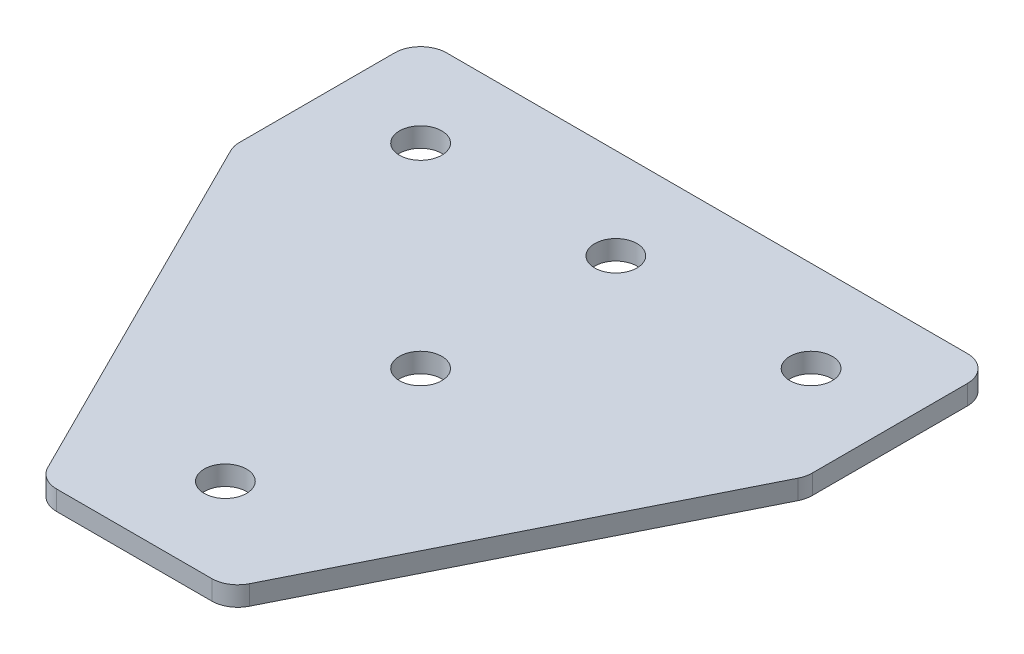
ISO-10303-21;
HEADER;
FILE_DESCRIPTION(('STEP AP214'),'2;1');
FILE_NAME('part.step','',(''),(''),'','','');
FILE_SCHEMA(('AUTOMOTIVE_DESIGN { 1 0 10303 214 1 1 1 1 }'));
ENDSEC;
DATA;
#1=APPLICATION_CONTEXT('core data for automotive mechanical design processes');
#2=APPLICATION_PROTOCOL_DEFINITION('international standard','automotive_design',2000,#1);
#3=PRODUCT_CONTEXT('',#1,'mechanical');
#4=PRODUCT('Part','Part','',(#3));
#5=PRODUCT_RELATED_PRODUCT_CATEGORY('part','',(#4));
#6=PRODUCT_DEFINITION_FORMATION('','',#4);
#7=PRODUCT_DEFINITION_CONTEXT('part definition',#1,'design');
#8=PRODUCT_DEFINITION('design','',#6,#7);
#9=PRODUCT_DEFINITION_SHAPE('','',#8);
#10=(LENGTH_UNIT() NAMED_UNIT(*) SI_UNIT(.MILLI.,.METRE.));
#11=(NAMED_UNIT(*) PLANE_ANGLE_UNIT() SI_UNIT($,.RADIAN.));
#12=(NAMED_UNIT(*) SI_UNIT($,.STERADIAN.) SOLID_ANGLE_UNIT());
#13=UNCERTAINTY_MEASURE_WITH_UNIT(LENGTH_MEASURE(1.E-05),#10,'distance_accuracy_value','');
#14=(GEOMETRIC_REPRESENTATION_CONTEXT(3) GLOBAL_UNCERTAINTY_ASSIGNED_CONTEXT((#13)) GLOBAL_UNIT_ASSIGNED_CONTEXT((#10,
#11,#12)) REPRESENTATION_CONTEXT('',''));
#15=CARTESIAN_POINT('',(0.,0.,0.));
#16=DIRECTION('',(0.,0.,1.));
#17=DIRECTION('',(1.,0.,0.));
#18=AXIS2_PLACEMENT_3D('',#15,#16,#17);
#19=CARTESIAN_POINT('',(-1.37420990733972,2.17462627720624,-16.5499410746997));
#20=DIRECTION('',(0.,-1.,0.));
#21=DIRECTION('',(0.,0.,-1.));
#22=AXIS2_PLACEMENT_3D('',#19,#20,#21);
#23=PLANE('',#22);
#24=CARTESIAN_POINT('',(-1.37420990733972,2.17462627720624,-16.5499410746997));
#25=DIRECTION('',(0.,1.,0.));
#26=DIRECTION('',(0.,0.,1.));
#27=AXIS2_PLACEMENT_3D('',#24,#25,#26);
#28=CIRCLE('',#27,1.625);
#29=CARTESIAN_POINT('',(-1.37420990733972,2.17462627720624,-14.9249410746997));
#30=VERTEX_POINT('',#29);
#31=EDGE_CURVE('E159',#30,#30,#28,.T.);
#32=ORIENTED_EDGE('',*,*,#31,.T.);
#33=EDGE_LOOP('',(#32));
#34=FACE_BOUND('',#33,.T.);
#35=DIRECTION('',(1.,0.,0.));
#36=VECTOR('',#35,1.);
#37=CARTESIAN_POINT('',(-8.37420990733981,2.17462627720624,20.4500589253003));
#38=LINE('',#37,#36);
#39=CARTESIAN_POINT('',(-7.32912493546507,2.17462627720624,20.4500589253003));
#40=VERTEX_POINT('',#39);
#41=CARTESIAN_POINT('',(4.58070512078563,2.17462627720624,20.4500589253003));
#42=VERTEX_POINT('',#41);
#43=EDGE_CURVE('E168',#40,#42,#38,.T.);
#44=ORIENTED_EDGE('',*,*,#43,.F.);
#45=CARTESIAN_POINT('',(-7.32912493546507,2.17462627720624,18.4500589253002));
#46=DIRECTION('',(0.,-1.,0.));
#47=DIRECTION('',(0.,0.,-1.));
#48=AXIS2_PLACEMENT_3D('',#45,#46,#47);
#49=CIRCLE('',#48,2.);
#50=CARTESIAN_POINT('',(-9.1179793174649,2.17462627720624,19.3444861163002));
#51=VERTEX_POINT('',#50);
#52=EDGE_CURVE('E212',#40,#51,#49,.T.);
#53=ORIENTED_EDGE('',*,*,#52,.T.);
#54=DIRECTION('',(-0.447213595499955,0.,-0.894427190999918));
#55=VECTOR('',#54,1.);
#56=CARTESIAN_POINT('',(-8.56519291296486,2.17462627720624,20.4500589253003));
#57=LINE('',#56,#55);
#58=CARTESIAN_POINT('',(-23.1630642893395,2.17462627720624,-8.74568382744922));
#59=VERTEX_POINT('',#58);
#60=EDGE_CURVE('E132',#51,#59,#57,.T.);
#61=ORIENTED_EDGE('',*,*,#60,.T.);
#62=CARTESIAN_POINT('',(-21.3742099073396,2.17462627720624,-9.64011101844913));
#63=DIRECTION('',(0.,-1.,0.));
#64=DIRECTION('',(0.,0.,-1.));
#65=AXIS2_PLACEMENT_3D('',#62,#63,#64);
#66=CIRCLE('',#65,2.);
#67=CARTESIAN_POINT('',(-23.3742099073396,2.17462627720624,-9.64011101844913));
#68=VERTEX_POINT('',#67);
#69=EDGE_CURVE('E186',#59,#68,#66,.T.);
#70=ORIENTED_EDGE('',*,*,#69,.T.);
#71=DIRECTION('',(0.,0.,-1.));
#72=VECTOR('',#71,1.);
#73=CARTESIAN_POINT('',(-23.3742099073396,2.17462627720624,-9.16797506344956));
#74=LINE('',#73,#72);
#75=CARTESIAN_POINT('',(-23.3742099073396,2.17462627720624,-21.5499410746997));
#76=VERTEX_POINT('',#75);
#77=EDGE_CURVE('E125',#68,#76,#74,.T.);
#78=ORIENTED_EDGE('',*,*,#77,.T.);
#79=CARTESIAN_POINT('',(-21.3742099073396,2.17462627720624,-21.5499410746997));
#80=DIRECTION('',(0.,-1.,0.));
#81=DIRECTION('',(0.,0.,-1.));
#82=AXIS2_PLACEMENT_3D('',#79,#80,#81);
#83=CIRCLE('',#82,2.);
#84=CARTESIAN_POINT('',(-21.3742099073396,2.17462627720624,-23.5499410746997));
#85=VERTEX_POINT('',#84);
#86=EDGE_CURVE('E205',#76,#85,#83,.T.);
#87=ORIENTED_EDGE('',*,*,#86,.T.);
#88=DIRECTION('',(-1.,0.,0.));
#89=VECTOR('',#88,1.);
#90=CARTESIAN_POINT('',(20.6257900926602,2.17462627720624,-23.5499410746998));
#91=LINE('',#90,#89);
#92=CARTESIAN_POINT('',(18.6257900926602,2.17462627720624,-23.5499410746998));
#93=VERTEX_POINT('',#92);
#94=EDGE_CURVE('E165',#93,#85,#91,.T.);
#95=ORIENTED_EDGE('',*,*,#94,.F.);
#96=CARTESIAN_POINT('',(18.6257900926602,2.17462627720624,-21.5499410746998));
#97=DIRECTION('',(0.,-1.,0.));
#98=DIRECTION('',(0.,0.,-1.));
#99=AXIS2_PLACEMENT_3D('',#96,#97,#98);
#100=CIRCLE('',#99,2.);
#101=CARTESIAN_POINT('',(20.6257900926602,2.17462627720624,-21.5499410746998));
#102=VERTEX_POINT('',#101);
#103=EDGE_CURVE('E207',#93,#102,#100,.T.);
#104=ORIENTED_EDGE('',*,*,#103,.T.);
#105=DIRECTION('',(0.,0.,-1.));
#106=VECTOR('',#105,1.);
#107=CARTESIAN_POINT('',(20.6257900926602,2.17462627720624,-9.16797506344956));
#108=LINE('',#107,#106);
#109=CARTESIAN_POINT('',(20.6257900926602,2.17462627720624,-9.64011101844913));
#110=VERTEX_POINT('',#109);
#111=EDGE_CURVE('E126',#110,#102,#108,.T.);
#112=ORIENTED_EDGE('',*,*,#111,.F.);
#113=CARTESIAN_POINT('',(18.6257900926602,2.17462627720624,-9.64011101844913));
#114=DIRECTION('',(0.,-1.,0.));
#115=DIRECTION('',(0.,0.,-1.));
#116=AXIS2_PLACEMENT_3D('',#113,#114,#115);
#117=CIRCLE('',#116,2.);
#118=CARTESIAN_POINT('',(20.41464447466,2.17462627720624,-8.74568382744923));
#119=VERTEX_POINT('',#118);
#120=EDGE_CURVE('E31',#110,#119,#117,.T.);
#121=ORIENTED_EDGE('',*,*,#120,.T.);
#122=DIRECTION('',(0.447213595499954,0.,-0.894427190999918));
#123=VECTOR('',#122,1.);
#124=CARTESIAN_POINT('',(5.81677309828543,2.17462627720624,20.4500589253003));
#125=LINE('',#124,#123);
#126=CARTESIAN_POINT('',(6.36955950278547,2.17462627720624,19.3444861163002));
#127=VERTEX_POINT('',#126);
#128=EDGE_CURVE('E172',#127,#119,#125,.T.);
#129=ORIENTED_EDGE('',*,*,#128,.F.);
#130=CARTESIAN_POINT('',(4.58070512078563,2.17462627720624,18.4500589253003));
#131=DIRECTION('',(0.,-1.,0.));
#132=DIRECTION('',(0.,0.,-1.));
#133=AXIS2_PLACEMENT_3D('',#130,#131,#132);
#134=CIRCLE('',#133,2.);
#135=EDGE_CURVE('E210',#127,#42,#134,.T.);
#136=ORIENTED_EDGE('',*,*,#135,.T.);
#137=EDGE_LOOP('',(#44,#53,#61,#70,#78,#87,#95,#104,#112,#121,#129,#136));
#138=FACE_BOUND('',#137,.T.);
#139=CARTESIAN_POINT('',(-1.37420990733973,2.17462627720624,13.4500589253003));
#140=DIRECTION('',(0.,1.,0.));
#141=DIRECTION('',(0.,0.,1.));
#142=AXIS2_PLACEMENT_3D('',#139,#140,#141);
#143=CIRCLE('',#142,1.625);
#144=CARTESIAN_POINT('',(-1.37420990733973,2.17462627720624,15.0750589253003));
#145=VERTEX_POINT('',#144);
#146=EDGE_CURVE('E140',#145,#145,#143,.T.);
#147=ORIENTED_EDGE('',*,*,#146,.T.);
#148=EDGE_LOOP('',(#147));
#149=FACE_BOUND('',#148,.T.);
#150=CARTESIAN_POINT('',(-1.37420990733973,2.17462627720624,-1.54994107469971));
#151=DIRECTION('',(0.,1.,0.));
#152=DIRECTION('',(0.,0.,1.));
#153=AXIS2_PLACEMENT_3D('',#150,#151,#152);
#154=CIRCLE('',#153,1.625);
#155=CARTESIAN_POINT('',(-1.37420990733973,2.17462627720624,0.0750589253002856));
#156=VERTEX_POINT('',#155);
#157=EDGE_CURVE('E147',#156,#156,#154,.T.);
#158=ORIENTED_EDGE('',*,*,#157,.T.);
#159=EDGE_LOOP('',(#158));
#160=FACE_BOUND('',#159,.T.);
#161=CARTESIAN_POINT('',(13.6257900926603,2.17462627720624,-16.5499410746997));
#162=DIRECTION('',(0.,1.,0.));
#163=DIRECTION('',(0.,0.,1.));
#164=AXIS2_PLACEMENT_3D('',#161,#162,#163);
#165=CIRCLE('',#164,1.625);
#166=CARTESIAN_POINT('',(13.6257900926603,2.17462627720624,-14.9249410746997));
#167=VERTEX_POINT('',#166);
#168=EDGE_CURVE('E153',#167,#167,#165,.T.);
#169=ORIENTED_EDGE('',*,*,#168,.T.);
#170=EDGE_LOOP('',(#169));
#171=FACE_BOUND('',#170,.T.);
#172=CARTESIAN_POINT('',(-16.3742099073397,2.17462627720624,-16.5499410746997));
#173=DIRECTION('',(0.,-1.,0.));
#174=DIRECTION('',(0.,0.,1.));
#175=AXIS2_PLACEMENT_3D('',#172,#173,#174);
#176=CIRCLE('',#175,1.625);
#177=CARTESIAN_POINT('',(-16.3742099073397,2.17462627720624,-14.9249410746997));
#178=VERTEX_POINT('',#177);
#179=EDGE_CURVE('E136',#178,#178,#176,.T.);
#180=ORIENTED_EDGE('',*,*,#179,.F.);
#181=EDGE_LOOP('',(#180));
#182=FACE_BOUND('',#181,.T.);
#183=ADVANCED_FACE('F16',(#34,#138,#149,#160,#171,#182),#23,.T.);
#184=CARTESIAN_POINT('',(20.6257900926602,2.17462627720624,-23.5499410746998));
#185=DIRECTION('',(0.,0.,-1.));
#186=DIRECTION('',(-1.,0.,0.));
#187=AXIS2_PLACEMENT_3D('',#184,#185,#186);
#188=PLANE('',#187);
#189=DIRECTION('',(-1.,0.,0.));
#190=VECTOR('',#189,1.);
#191=CARTESIAN_POINT('',(20.6257900926602,3.67462627720624,-23.5499410746998));
#192=LINE('',#191,#190);
#193=CARTESIAN_POINT('',(18.6257900926602,3.67462627720624,-23.5499410746998));
#194=VERTEX_POINT('',#193);
#195=CARTESIAN_POINT('',(-21.3742099073396,3.67462627720624,-23.5499410746997));
#196=VERTEX_POINT('',#195);
#197=EDGE_CURVE('E162',#194,#196,#192,.T.);
#198=ORIENTED_EDGE('',*,*,#197,.F.);
#199=DIRECTION('',(0.,1.,0.));
#200=VECTOR('',#199,1.);
#201=CARTESIAN_POINT('',(18.6257900926602,2.17462627720624,-23.5499410746998));
#202=LINE('',#201,#200);
#203=EDGE_CURVE('E24',#194,#93,#202,.F.);
#204=ORIENTED_EDGE('',*,*,#203,.T.);
#205=ORIENTED_EDGE('',*,*,#94,.T.);
#206=DIRECTION('',(0.,1.,0.));
#207=VECTOR('',#206,1.);
#208=CARTESIAN_POINT('',(-21.3742099073396,2.17462627720624,-23.5499410746997));
#209=LINE('',#208,#207);
#210=EDGE_CURVE('E223',#85,#196,#209,.T.);
#211=ORIENTED_EDGE('',*,*,#210,.T.);
#212=EDGE_LOOP('',(#198,#204,#205,#211));
#213=FACE_BOUND('',#212,.T.);
#214=ADVANCED_FACE('F229',(#213),#188,.T.);
#215=CARTESIAN_POINT('',(20.6257900926602,2.17462627720624,-9.16797506344956));
#216=DIRECTION('',(1.,0.,0.));
#217=DIRECTION('',(0.,0.,-1.));
#218=AXIS2_PLACEMENT_3D('',#215,#216,#217);
#219=PLANE('',#218);
#220=DIRECTION('',(0.,0.,-1.));
#221=VECTOR('',#220,1.);
#222=CARTESIAN_POINT('',(20.6257900926602,3.67462627720624,-9.16797506344956));
#223=LINE('',#222,#221);
#224=CARTESIAN_POINT('',(20.6257900926602,3.67462627720624,-9.64011101844913));
#225=VERTEX_POINT('',#224);
#226=CARTESIAN_POINT('',(20.6257900926602,3.67462627720624,-21.5499410746998));
#227=VERTEX_POINT('',#226);
#228=EDGE_CURVE('E169',#225,#227,#223,.T.);
#229=ORIENTED_EDGE('',*,*,#228,.F.);
#230=DIRECTION('',(0.,1.,0.));
#231=VECTOR('',#230,1.);
#232=CARTESIAN_POINT('',(20.6257900926602,2.17462627720624,-9.64011101844913));
#233=LINE('',#232,#231);
#234=EDGE_CURVE('E221',#225,#110,#233,.F.);
#235=ORIENTED_EDGE('',*,*,#234,.T.);
#236=ORIENTED_EDGE('',*,*,#111,.T.);
#237=DIRECTION('',(0.,1.,0.));
#238=VECTOR('',#237,1.);
#239=CARTESIAN_POINT('',(20.6257900926602,2.17462627720624,-21.5499410746998));
#240=LINE('',#239,#238);
#241=EDGE_CURVE('E218',#102,#227,#240,.T.);
#242=ORIENTED_EDGE('',*,*,#241,.T.);
#243=EDGE_LOOP('',(#229,#235,#236,#242));
#244=FACE_BOUND('',#243,.T.);
#245=ADVANCED_FACE('F240',(#244),#219,.T.);
#246=CARTESIAN_POINT('',(5.81677309828543,2.17462627720624,20.4500589253003));
#247=DIRECTION('',(0.894427190999918,0.,0.447213595499954));
#248=DIRECTION('',(0.447213595499954,0.,-0.894427190999918));
#249=AXIS2_PLACEMENT_3D('',#246,#247,#248);
#250=PLANE('',#249);
#251=DIRECTION('',(0.447213595499954,0.,-0.894427190999918));
#252=VECTOR('',#251,1.);
#253=CARTESIAN_POINT('',(5.81677309828543,3.67462627720624,20.4500589253003));
#254=LINE('',#253,#252);
#255=CARTESIAN_POINT('',(6.36955950278547,3.67462627720624,19.3444861163002));
#256=VERTEX_POINT('',#255);
#257=CARTESIAN_POINT('',(20.41464447466,3.67462627720624,-8.74568382744923));
#258=VERTEX_POINT('',#257);
#259=EDGE_CURVE('E180',#256,#258,#254,.T.);
#260=ORIENTED_EDGE('',*,*,#259,.F.);
#261=DIRECTION('',(0.,1.,0.));
#262=VECTOR('',#261,1.);
#263=CARTESIAN_POINT('',(6.36955950278547,2.17462627720624,19.3444861163002));
#264=LINE('',#263,#262);
#265=EDGE_CURVE('E38',#256,#127,#264,.F.);
#266=ORIENTED_EDGE('',*,*,#265,.T.);
#267=ORIENTED_EDGE('',*,*,#128,.T.);
#268=DIRECTION('',(0.,1.,0.));
#269=VECTOR('',#268,1.);
#270=CARTESIAN_POINT('',(20.41464447466,2.17462627720624,-8.74568382744922));
#271=LINE('',#270,#269);
#272=EDGE_CURVE('E214',#119,#258,#271,.T.);
#273=ORIENTED_EDGE('',*,*,#272,.T.);
#274=EDGE_LOOP('',(#260,#266,#267,#273));
#275=FACE_BOUND('',#274,.T.);
#276=ADVANCED_FACE('F245',(#275),#250,.T.);
#277=CARTESIAN_POINT('',(-8.37420990733981,2.17462627720624,20.4500589253003));
#278=DIRECTION('',(0.,0.,1.));
#279=DIRECTION('',(1.,0.,0.));
#280=AXIS2_PLACEMENT_3D('',#277,#278,#279);
#281=PLANE('',#280);
#282=DIRECTION('',(1.,0.,0.));
#283=VECTOR('',#282,1.);
#284=CARTESIAN_POINT('',(-8.37420990733981,3.67462627720624,20.4500589253003));
#285=LINE('',#284,#283);
#286=CARTESIAN_POINT('',(-7.32912493546507,3.67462627720624,20.4500589253003));
#287=VERTEX_POINT('',#286);
#288=CARTESIAN_POINT('',(4.58070512078563,3.67462627720624,20.4500589253003));
#289=VERTEX_POINT('',#288);
#290=EDGE_CURVE('E177',#287,#289,#285,.T.);
#291=ORIENTED_EDGE('',*,*,#290,.F.);
#292=DIRECTION('',(0.,1.,0.));
#293=VECTOR('',#292,1.);
#294=CARTESIAN_POINT('',(-7.32912493546507,2.17462627720624,20.4500589253003));
#295=LINE('',#294,#293);
#296=EDGE_CURVE('E203',#287,#40,#295,.F.);
#297=ORIENTED_EDGE('',*,*,#296,.T.);
#298=ORIENTED_EDGE('',*,*,#43,.T.);
#299=DIRECTION('',(0.,1.,0.));
#300=VECTOR('',#299,1.);
#301=CARTESIAN_POINT('',(4.58070512078563,2.17462627720624,20.4500589253003));
#302=LINE('',#301,#300);
#303=EDGE_CURVE('E200',#42,#289,#302,.T.);
#304=ORIENTED_EDGE('',*,*,#303,.T.);
#305=EDGE_LOOP('',(#291,#297,#298,#304));
#306=FACE_BOUND('',#305,.T.);
#307=ADVANCED_FACE('F252',(#306),#281,.T.);
#308=CARTESIAN_POINT('',(-1.37420990733972,3.67462627720624,-16.5499410746997));
#309=DIRECTION('',(0.,-1.,0.));
#310=DIRECTION('',(0.,0.,-1.));
#311=AXIS2_PLACEMENT_3D('',#308,#309,#310);
#312=PLANE('',#311);
#313=CARTESIAN_POINT('',(-1.37420990733972,3.67462627720624,-16.5499410746997));
#314=DIRECTION('',(0.,1.,0.));
#315=DIRECTION('',(0.,0.,1.));
#316=AXIS2_PLACEMENT_3D('',#313,#314,#315);
#317=CIRCLE('',#316,1.625);
#318=CARTESIAN_POINT('',(-1.37420990733972,3.67462627720624,-14.9249410746997));
#319=VERTEX_POINT('',#318);
#320=EDGE_CURVE('E156',#319,#319,#317,.T.);
#321=ORIENTED_EDGE('',*,*,#320,.F.);
#322=EDGE_LOOP('',(#321));
#323=FACE_BOUND('',#322,.T.);
#324=DIRECTION('',(-0.447213595499955,0.,-0.894427190999918));
#325=VECTOR('',#324,1.);
#326=CARTESIAN_POINT('',(-8.56519291296486,3.67462627720624,20.4500589253003));
#327=LINE('',#326,#325);
#328=CARTESIAN_POINT('',(-9.1179793174649,3.67462627720624,19.3444861163002));
#329=VERTEX_POINT('',#328);
#330=CARTESIAN_POINT('',(-23.1630642893395,3.67462627720624,-8.74568382744922));
#331=VERTEX_POINT('',#330);
#332=EDGE_CURVE('E133',#329,#331,#327,.T.);
#333=ORIENTED_EDGE('',*,*,#332,.F.);
#334=CARTESIAN_POINT('',(-7.32912493546507,3.67462627720624,18.4500589253002));
#335=DIRECTION('',(0.,-1.,0.));
#336=DIRECTION('',(0.,0.,-1.));
#337=AXIS2_PLACEMENT_3D('',#334,#335,#336);
#338=CIRCLE('',#337,2.);
#339=EDGE_CURVE('E198',#329,#287,#338,.F.);
#340=ORIENTED_EDGE('',*,*,#339,.T.);
#341=ORIENTED_EDGE('',*,*,#290,.T.);
#342=CARTESIAN_POINT('',(4.58070512078563,3.67462627720624,18.4500589253003));
#343=DIRECTION('',(0.,-1.,0.));
#344=DIRECTION('',(0.,0.,-1.));
#345=AXIS2_PLACEMENT_3D('',#342,#343,#344);
#346=CIRCLE('',#345,2.);
#347=EDGE_CURVE('E196',#289,#256,#346,.F.);
#348=ORIENTED_EDGE('',*,*,#347,.T.);
#349=ORIENTED_EDGE('',*,*,#259,.T.);
#350=CARTESIAN_POINT('',(18.6257900926602,3.67462627720624,-9.64011101844913));
#351=DIRECTION('',(0.,-1.,0.));
#352=DIRECTION('',(0.,0.,-1.));
#353=AXIS2_PLACEMENT_3D('',#350,#351,#352);
#354=CIRCLE('',#353,2.);
#355=EDGE_CURVE('E194',#258,#225,#354,.F.);
#356=ORIENTED_EDGE('',*,*,#355,.T.);
#357=ORIENTED_EDGE('',*,*,#228,.T.);
#358=CARTESIAN_POINT('',(18.6257900926602,3.67462627720624,-21.5499410746998));
#359=DIRECTION('',(0.,-1.,0.));
#360=DIRECTION('',(0.,0.,-1.));
#361=AXIS2_PLACEMENT_3D('',#358,#359,#360);
#362=CIRCLE('',#361,2.);
#363=EDGE_CURVE('E192',#227,#194,#362,.F.);
#364=ORIENTED_EDGE('',*,*,#363,.T.);
#365=ORIENTED_EDGE('',*,*,#197,.T.);
#366=CARTESIAN_POINT('',(-21.3742099073396,3.67462627720624,-21.5499410746997));
#367=DIRECTION('',(0.,-1.,0.));
#368=DIRECTION('',(0.,0.,-1.));
#369=AXIS2_PLACEMENT_3D('',#366,#367,#368);
#370=CIRCLE('',#369,2.);
#371=CARTESIAN_POINT('',(-23.3742099073396,3.67462627720624,-21.5499410746997));
#372=VERTEX_POINT('',#371);
#373=EDGE_CURVE('E131',#196,#372,#370,.F.);
#374=ORIENTED_EDGE('',*,*,#373,.T.);
#375=DIRECTION('',(0.,0.,-1.));
#376=VECTOR('',#375,1.);
#377=CARTESIAN_POINT('',(-23.3742099073396,3.67462627720624,-9.16797506344956));
#378=LINE('',#377,#376);
#379=CARTESIAN_POINT('',(-23.3742099073396,3.67462627720624,-9.64011101844913));
#380=VERTEX_POINT('',#379);
#381=EDGE_CURVE('E122',#380,#372,#378,.T.);
#382=ORIENTED_EDGE('',*,*,#381,.F.);
#383=CARTESIAN_POINT('',(-21.3742099073396,3.67462627720624,-9.64011101844913));
#384=DIRECTION('',(0.,-1.,0.));
#385=DIRECTION('',(0.,0.,-1.));
#386=AXIS2_PLACEMENT_3D('',#383,#384,#385);
#387=CIRCLE('',#386,2.);
#388=EDGE_CURVE('E107',#380,#331,#387,.F.);
#389=ORIENTED_EDGE('',*,*,#388,.T.);
#390=EDGE_LOOP('',(#333,#340,#341,#348,#349,#356,#357,#364,#365,#374,#382,#389));
#391=FACE_BOUND('',#390,.T.);
#392=CARTESIAN_POINT('',(-1.37420990733973,3.67462627720624,13.4500589253003));
#393=DIRECTION('',(0.,1.,0.));
#394=DIRECTION('',(0.,0.,1.));
#395=AXIS2_PLACEMENT_3D('',#392,#393,#394);
#396=CIRCLE('',#395,1.625);
#397=CARTESIAN_POINT('',(-1.37420990733973,3.67462627720624,15.0750589253003));
#398=VERTEX_POINT('',#397);
#399=EDGE_CURVE('E144',#398,#398,#396,.T.);
#400=ORIENTED_EDGE('',*,*,#399,.F.);
#401=EDGE_LOOP('',(#400));
#402=FACE_BOUND('',#401,.T.);
#403=CARTESIAN_POINT('',(13.6257900926603,3.67462627720624,-16.5499410746997));
#404=DIRECTION('',(0.,1.,0.));
#405=DIRECTION('',(0.,0.,1.));
#406=AXIS2_PLACEMENT_3D('',#403,#404,#405);
#407=CIRCLE('',#406,1.625);
#408=CARTESIAN_POINT('',(13.6257900926603,3.67462627720624,-14.9249410746997));
#409=VERTEX_POINT('',#408);
#410=EDGE_CURVE('E150',#409,#409,#407,.T.);
#411=ORIENTED_EDGE('',*,*,#410,.F.);
#412=EDGE_LOOP('',(#411));
#413=FACE_BOUND('',#412,.T.);
#414=CARTESIAN_POINT('',(-1.37420990733973,3.67462627720624,-1.54994107469971));
#415=DIRECTION('',(0.,1.,0.));
#416=DIRECTION('',(0.,0.,1.));
#417=AXIS2_PLACEMENT_3D('',#414,#415,#416);
#418=CIRCLE('',#417,1.625);
#419=CARTESIAN_POINT('',(-1.37420990733973,3.67462627720624,0.0750589253002856));
#420=VERTEX_POINT('',#419);
#421=EDGE_CURVE('E143',#420,#420,#418,.T.);
#422=ORIENTED_EDGE('',*,*,#421,.F.);
#423=EDGE_LOOP('',(#422));
#424=FACE_BOUND('',#423,.T.);
#425=CARTESIAN_POINT('',(-16.3742099073397,3.67462627720624,-16.5499410746997));
#426=DIRECTION('',(0.,-1.,0.));
#427=DIRECTION('',(0.,0.,1.));
#428=AXIS2_PLACEMENT_3D('',#425,#426,#427);
#429=CIRCLE('',#428,1.625);
#430=CARTESIAN_POINT('',(-16.3742099073397,3.67462627720624,-14.9249410746997));
#431=VERTEX_POINT('',#430);
#432=EDGE_CURVE('E444',#431,#431,#429,.T.);
#433=ORIENTED_EDGE('',*,*,#432,.T.);
#434=EDGE_LOOP('',(#433));
#435=FACE_BOUND('',#434,.T.);
#436=ADVANCED_FACE('F128',(#323,#391,#402,#413,#424,#435),#312,.F.);
#437=CARTESIAN_POINT('',(-1.37420990733972,2.17462627720624,-16.5499410746997));
#438=DIRECTION('',(0.,1.,0.));
#439=DIRECTION('',(0.,0.,1.));
#440=AXIS2_PLACEMENT_3D('',#437,#438,#439);
#441=CYLINDRICAL_SURFACE('',#440,1.625);
#442=ORIENTED_EDGE('',*,*,#31,.F.);
#443=EDGE_LOOP('',(#442));
#444=FACE_BOUND('',#443,.T.);
#445=ORIENTED_EDGE('',*,*,#320,.T.);
#446=EDGE_LOOP('',(#445));
#447=FACE_BOUND('',#446,.T.);
#448=ADVANCED_FACE('F370',(#444,#447),#441,.F.);
#449=CARTESIAN_POINT('',(13.6257900926603,2.17462627720624,-16.5499410746997));
#450=DIRECTION('',(0.,1.,0.));
#451=DIRECTION('',(0.,0.,1.));
#452=AXIS2_PLACEMENT_3D('',#449,#450,#451);
#453=CYLINDRICAL_SURFACE('',#452,1.625);
#454=ORIENTED_EDGE('',*,*,#168,.F.);
#455=EDGE_LOOP('',(#454));
#456=FACE_BOUND('',#455,.T.);
#457=ORIENTED_EDGE('',*,*,#410,.T.);
#458=EDGE_LOOP('',(#457));
#459=FACE_BOUND('',#458,.T.);
#460=ADVANCED_FACE('F361',(#456,#459),#453,.F.);
#461=CARTESIAN_POINT('',(-1.37420990733973,2.17462627720624,-1.54994107469971));
#462=DIRECTION('',(0.,1.,0.));
#463=DIRECTION('',(0.,0.,1.));
#464=AXIS2_PLACEMENT_3D('',#461,#462,#463);
#465=CYLINDRICAL_SURFACE('',#464,1.625);
#466=ORIENTED_EDGE('',*,*,#421,.T.);
#467=EDGE_LOOP('',(#466));
#468=FACE_BOUND('',#467,.T.);
#469=ORIENTED_EDGE('',*,*,#157,.F.);
#470=EDGE_LOOP('',(#469));
#471=FACE_BOUND('',#470,.T.);
#472=ADVANCED_FACE('F352',(#468,#471),#465,.F.);
#473=CARTESIAN_POINT('',(-1.37420990733973,2.17462627720624,13.4500589253003));
#474=DIRECTION('',(0.,1.,0.));
#475=DIRECTION('',(0.,0.,1.));
#476=AXIS2_PLACEMENT_3D('',#473,#474,#475);
#477=CYLINDRICAL_SURFACE('',#476,1.625);
#478=ORIENTED_EDGE('',*,*,#399,.T.);
#479=EDGE_LOOP('',(#478));
#480=FACE_BOUND('',#479,.T.);
#481=ORIENTED_EDGE('',*,*,#146,.F.);
#482=EDGE_LOOP('',(#481));
#483=FACE_BOUND('',#482,.T.);
#484=ADVANCED_FACE('F344',(#480,#483),#477,.F.);
#485=CARTESIAN_POINT('',(-23.3742099073396,2.17462627720624,-9.16797506344956));
#486=DIRECTION('',(-1.,0.,0.));
#487=DIRECTION('',(0.,0.,-1.));
#488=AXIS2_PLACEMENT_3D('',#485,#486,#487);
#489=PLANE('',#488);
#490=ORIENTED_EDGE('',*,*,#381,.T.);
#491=DIRECTION('',(0.,1.,0.));
#492=VECTOR('',#491,1.);
#493=CARTESIAN_POINT('',(-23.3742099073396,2.17462627720624,-21.5499410746997));
#494=LINE('',#493,#492);
#495=EDGE_CURVE('E10',#372,#76,#494,.F.);
#496=ORIENTED_EDGE('',*,*,#495,.T.);
#497=ORIENTED_EDGE('',*,*,#77,.F.);
#498=DIRECTION('',(0.,1.,0.));
#499=VECTOR('',#498,1.);
#500=CARTESIAN_POINT('',(-23.3742099073396,2.17462627720624,-9.64011101844913));
#501=LINE('',#500,#499);
#502=EDGE_CURVE('E111',#68,#380,#501,.T.);
#503=ORIENTED_EDGE('',*,*,#502,.T.);
#504=EDGE_LOOP('',(#490,#496,#497,#503));
#505=FACE_BOUND('',#504,.T.);
#506=ADVANCED_FACE('F121',(#505),#489,.T.);
#507=CARTESIAN_POINT('',(-8.56519291296486,2.17462627720624,20.4500589253003));
#508=DIRECTION('',(-0.894427190999918,0.,0.447213595499954));
#509=DIRECTION('',(-0.447213595499955,0.,-0.894427190999918));
#510=AXIS2_PLACEMENT_3D('',#507,#508,#509);
#511=PLANE('',#510);
#512=ORIENTED_EDGE('',*,*,#60,.F.);
#513=DIRECTION('',(0.,1.,0.));
#514=VECTOR('',#513,1.);
#515=CARTESIAN_POINT('',(-9.1179793174649,2.17462627720624,19.3444861163002));
#516=LINE('',#515,#514);
#517=EDGE_CURVE('E188',#51,#329,#516,.T.);
#518=ORIENTED_EDGE('',*,*,#517,.T.);
#519=ORIENTED_EDGE('',*,*,#332,.T.);
#520=DIRECTION('',(0.,1.,0.));
#521=VECTOR('',#520,1.);
#522=CARTESIAN_POINT('',(-23.1630642893395,2.17462627720624,-8.74568382744922));
#523=LINE('',#522,#521);
#524=EDGE_CURVE('E113',#331,#59,#523,.F.);
#525=ORIENTED_EDGE('',*,*,#524,.T.);
#526=EDGE_LOOP('',(#512,#518,#519,#525));
#527=FACE_BOUND('',#526,.T.);
#528=ADVANCED_FACE('F260',(#527),#511,.T.);
#529=CARTESIAN_POINT('',(-16.3742099073397,2.17462627720624,-16.5499410746997));
#530=DIRECTION('',(0.,1.,0.));
#531=DIRECTION('',(0.,0.,1.));
#532=AXIS2_PLACEMENT_3D('',#529,#530,#531);
#533=CYLINDRICAL_SURFACE('',#532,1.625);
#534=ORIENTED_EDGE('',*,*,#179,.T.);
#535=EDGE_LOOP('',(#534));
#536=FACE_BOUND('',#535,.T.);
#537=ORIENTED_EDGE('',*,*,#432,.F.);
#538=EDGE_LOOP('',(#537));
#539=FACE_BOUND('',#538,.T.);
#540=ADVANCED_FACE('F278',(#536,#539),#533,.F.);
#541=CARTESIAN_POINT('',(-21.3742099073396,2.17462627720624,-9.64011101844913));
#542=DIRECTION('',(0.,1.,0.));
#543=DIRECTION('',(0.,0.,1.));
#544=AXIS2_PLACEMENT_3D('',#541,#542,#543);
#545=CYLINDRICAL_SURFACE('',#544,2.);
#546=ORIENTED_EDGE('',*,*,#69,.F.);
#547=ORIENTED_EDGE('',*,*,#524,.F.);
#548=ORIENTED_EDGE('',*,*,#388,.F.);
#549=ORIENTED_EDGE('',*,*,#502,.F.);
#550=EDGE_LOOP('',(#546,#547,#548,#549));
#551=FACE_BOUND('',#550,.T.);
#552=ADVANCED_FACE('F110',(#551),#545,.T.);
#553=CARTESIAN_POINT('',(-7.32912493546507,2.17462627720624,18.4500589253002));
#554=DIRECTION('',(0.,1.,0.));
#555=DIRECTION('',(0.,0.,1.));
#556=AXIS2_PLACEMENT_3D('',#553,#554,#555);
#557=CYLINDRICAL_SURFACE('',#556,2.);
#558=ORIENTED_EDGE('',*,*,#52,.F.);
#559=ORIENTED_EDGE('',*,*,#296,.F.);
#560=ORIENTED_EDGE('',*,*,#339,.F.);
#561=ORIENTED_EDGE('',*,*,#517,.F.);
#562=EDGE_LOOP('',(#558,#559,#560,#561));
#563=FACE_BOUND('',#562,.T.);
#564=ADVANCED_FACE('F257',(#563),#557,.T.);
#565=CARTESIAN_POINT('',(4.58070512078563,2.17462627720624,18.4500589253003));
#566=DIRECTION('',(0.,1.,0.));
#567=DIRECTION('',(0.,0.,1.));
#568=AXIS2_PLACEMENT_3D('',#565,#566,#567);
#569=CYLINDRICAL_SURFACE('',#568,2.);
#570=ORIENTED_EDGE('',*,*,#135,.F.);
#571=ORIENTED_EDGE('',*,*,#265,.F.);
#572=ORIENTED_EDGE('',*,*,#347,.F.);
#573=ORIENTED_EDGE('',*,*,#303,.F.);
#574=EDGE_LOOP('',(#570,#571,#572,#573));
#575=FACE_BOUND('',#574,.T.);
#576=ADVANCED_FACE('F249',(#575),#569,.T.);
#577=CARTESIAN_POINT('',(18.6257900926602,2.17462627720624,-9.64011101844913));
#578=DIRECTION('',(0.,1.,0.));
#579=DIRECTION('',(0.,0.,1.));
#580=AXIS2_PLACEMENT_3D('',#577,#578,#579);
#581=CYLINDRICAL_SURFACE('',#580,2.);
#582=ORIENTED_EDGE('',*,*,#120,.F.);
#583=ORIENTED_EDGE('',*,*,#234,.F.);
#584=ORIENTED_EDGE('',*,*,#355,.F.);
#585=ORIENTED_EDGE('',*,*,#272,.F.);
#586=EDGE_LOOP('',(#582,#583,#584,#585));
#587=FACE_BOUND('',#586,.T.);
#588=ADVANCED_FACE('F244',(#587),#581,.T.);
#589=CARTESIAN_POINT('',(18.6257900926602,2.17462627720624,-21.5499410746998));
#590=DIRECTION('',(0.,1.,0.));
#591=DIRECTION('',(0.,0.,1.));
#592=AXIS2_PLACEMENT_3D('',#589,#590,#591);
#593=CYLINDRICAL_SURFACE('',#592,2.);
#594=ORIENTED_EDGE('',*,*,#103,.F.);
#595=ORIENTED_EDGE('',*,*,#203,.F.);
#596=ORIENTED_EDGE('',*,*,#363,.F.);
#597=ORIENTED_EDGE('',*,*,#241,.F.);
#598=EDGE_LOOP('',(#594,#595,#596,#597));
#599=FACE_BOUND('',#598,.T.);
#600=ADVANCED_FACE('F237',(#599),#593,.T.);
#601=CARTESIAN_POINT('',(-21.3742099073396,2.17462627720624,-21.5499410746997));
#602=DIRECTION('',(0.,1.,0.));
#603=DIRECTION('',(0.,0.,1.));
#604=AXIS2_PLACEMENT_3D('',#601,#602,#603);
#605=CYLINDRICAL_SURFACE('',#604,2.);
#606=ORIENTED_EDGE('',*,*,#86,.F.);
#607=ORIENTED_EDGE('',*,*,#495,.F.);
#608=ORIENTED_EDGE('',*,*,#373,.F.);
#609=ORIENTED_EDGE('',*,*,#210,.F.);
#610=EDGE_LOOP('',(#606,#607,#608,#609));
#611=FACE_BOUND('',#610,.T.);
#612=ADVANCED_FACE('F18',(#611),#605,.T.);
#613=CLOSED_SHELL('',(#183,#214,#245,#276,#307,#436,#448,#460,#472,#484,#506,#528,#540,#552,
#564,#576,#588,#600,#612));
#614=MANIFOLD_SOLID_BREP('B1',#613);
#615=ADVANCED_BREP_SHAPE_REPRESENTATION('',(#18,#614),#14);
#616=SHAPE_DEFINITION_REPRESENTATION(#9,#615);
ENDSEC;
END-ISO-10303-21;
